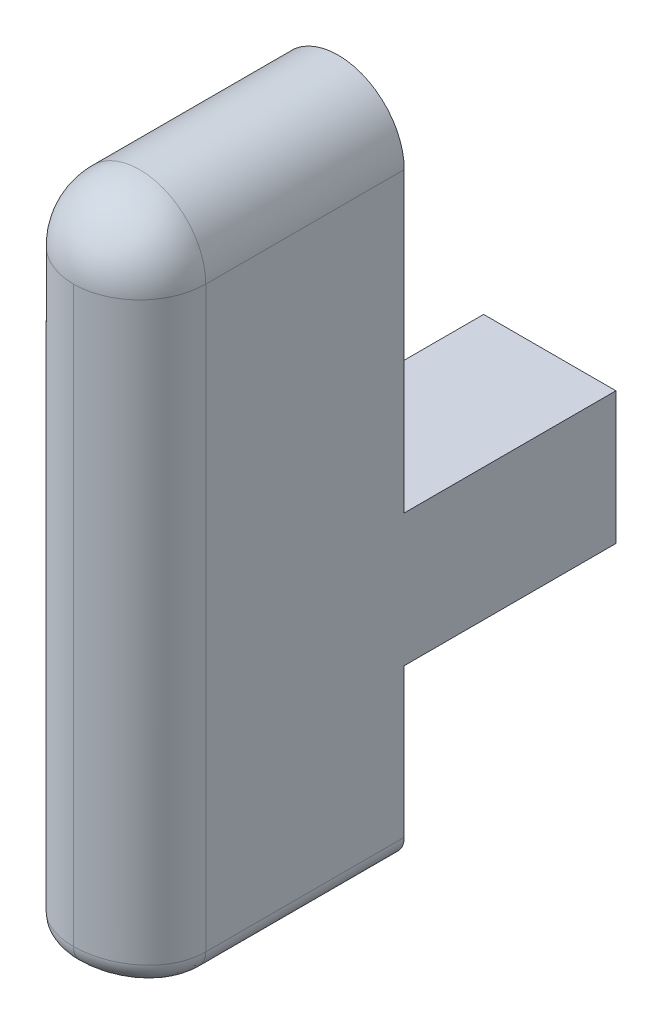
ISO-10303-21;
HEADER;
FILE_DESCRIPTION(('STEP AP214'),'2;1');
FILE_NAME('part.step','',(''),(''),'','','');
FILE_SCHEMA(('AUTOMOTIVE_DESIGN { 1 0 10303 214 1 1 1 1 }'));
ENDSEC;
DATA;
#1=APPLICATION_CONTEXT('core data for automotive mechanical design processes');
#2=APPLICATION_PROTOCOL_DEFINITION('international standard','automotive_design',2000,#1);
#3=PRODUCT_CONTEXT('',#1,'mechanical');
#4=PRODUCT('Part','Part','',(#3));
#5=PRODUCT_RELATED_PRODUCT_CATEGORY('part','',(#4));
#6=PRODUCT_DEFINITION_FORMATION('','',#4);
#7=PRODUCT_DEFINITION_CONTEXT('part definition',#1,'design');
#8=PRODUCT_DEFINITION('design','',#6,#7);
#9=PRODUCT_DEFINITION_SHAPE('','',#8);
#10=(LENGTH_UNIT() NAMED_UNIT(*) SI_UNIT(.MILLI.,.METRE.));
#11=(NAMED_UNIT(*) PLANE_ANGLE_UNIT() SI_UNIT($,.RADIAN.));
#12=(NAMED_UNIT(*) SI_UNIT($,.STERADIAN.) SOLID_ANGLE_UNIT());
#13=UNCERTAINTY_MEASURE_WITH_UNIT(LENGTH_MEASURE(1.E-05),#10,'distance_accuracy_value','');
#14=(GEOMETRIC_REPRESENTATION_CONTEXT(3) GLOBAL_UNCERTAINTY_ASSIGNED_CONTEXT((#13)) GLOBAL_UNIT_ASSIGNED_CONTEXT((#10,
#11,#12)) REPRESENTATION_CONTEXT('',''));
#15=CARTESIAN_POINT('',(0.,0.,0.));
#16=DIRECTION('',(0.,0.,1.));
#17=DIRECTION('',(1.,0.,0.));
#18=AXIS2_PLACEMENT_3D('',#15,#16,#17);
#19=CARTESIAN_POINT('',(29.6862500346852,-147.168099904877,3.175));
#20=DIRECTION('',(1.,0.,0.));
#21=DIRECTION('',(0.,0.,-1.));
#22=AXIS2_PLACEMENT_3D('',#19,#20,#21);
#23=PLANE('',#22);
#24=DIRECTION('',(0.,-1.,0.));
#25=VECTOR('',#24,1.);
#26=CARTESIAN_POINT('',(29.6862500346852,-147.168099904877,0.));
#27=LINE('',#26,#25);
#28=CARTESIAN_POINT('',(29.6862500346852,-152.324299852115,0.));
#29=VERTEX_POINT('',#28);
#30=CARTESIAN_POINT('',(29.6862500346852,-154.10736760588,0.));
#31=VERTEX_POINT('',#30);
#32=EDGE_CURVE('E160',#29,#31,#27,.T.);
#33=ORIENTED_EDGE('',*,*,#32,.T.);
#34=DIRECTION('',(0.,0.,1.));
#35=VECTOR('',#34,1.);
#36=CARTESIAN_POINT('',(29.6862500346852,-154.10736760588,2.38125));
#37=LINE('',#36,#35);
#38=CARTESIAN_POINT('',(29.6862500346852,-154.10736760588,2.38125));
#39=VERTEX_POINT('',#38);
#40=EDGE_CURVE('E11',#31,#39,#37,.T.);
#41=ORIENTED_EDGE('',*,*,#40,.T.);
#42=DIRECTION('',(0.,-1.,0.));
#43=VECTOR('',#42,1.);
#44=CARTESIAN_POINT('',(29.6862500346852,-147.168099904877,2.38125));
#45=LINE('',#44,#43);
#46=CARTESIAN_POINT('',(29.6862500346852,-147.168099904877,2.38125));
#47=VERTEX_POINT('',#46);
#48=EDGE_CURVE('E321',#39,#47,#45,.F.);
#49=ORIENTED_EDGE('',*,*,#48,.T.);
#50=DIRECTION('',(0.,0.,-1.));
#51=VECTOR('',#50,1.);
#52=CARTESIAN_POINT('',(29.6862500346852,-147.168099904877,3.175));
#53=LINE('',#52,#51);
#54=CARTESIAN_POINT('',(29.6862500346852,-147.168099904877,0.));
#55=VERTEX_POINT('',#54);
#56=EDGE_CURVE('E194',#47,#55,#53,.T.);
#57=ORIENTED_EDGE('',*,*,#56,.T.);
#58=CARTESIAN_POINT('',(29.6862500346852,-150.736799852115,0.));
#59=VERTEX_POINT('',#58);
#60=EDGE_CURVE('E188',#55,#59,#27,.T.);
#61=ORIENTED_EDGE('',*,*,#60,.T.);
#62=DIRECTION('',(0.,0.,1.));
#63=VECTOR('',#62,1.);
#64=CARTESIAN_POINT('',(29.6862500346852,-150.736799852115,-2.54000000000001));
#65=LINE('',#64,#63);
#66=CARTESIAN_POINT('',(29.6862500346852,-150.736799852115,-2.54000000000001));
#67=VERTEX_POINT('',#66);
#68=EDGE_CURVE('E162',#67,#59,#65,.T.);
#69=ORIENTED_EDGE('',*,*,#68,.F.);
#70=DIRECTION('',(0.,1.,0.));
#71=VECTOR('',#70,1.);
#72=CARTESIAN_POINT('',(29.6862500346852,-152.324299852115,-2.54));
#73=LINE('',#72,#71);
#74=CARTESIAN_POINT('',(29.6862500346852,-152.324299852115,-2.54));
#75=VERTEX_POINT('',#74);
#76=EDGE_CURVE('E140',#75,#67,#73,.T.);
#77=ORIENTED_EDGE('',*,*,#76,.F.);
#78=DIRECTION('',(0.,0.,1.));
#79=VECTOR('',#78,1.);
#80=CARTESIAN_POINT('',(29.6862500346852,-152.324299852115,-2.54));
#81=LINE('',#80,#79);
#82=EDGE_CURVE('E137',#75,#29,#81,.T.);
#83=ORIENTED_EDGE('',*,*,#82,.T.);
#84=EDGE_LOOP('',(#33,#41,#49,#57,#61,#69,#77,#83));
#85=FACE_BOUND('',#84,.T.);
#86=ADVANCED_FACE('F38',(#85),#23,.F.);
#87=CARTESIAN_POINT('',(31.2737500346852,-147.168099904877,3.175));
#88=DIRECTION('',(-1.,0.,0.));
#89=DIRECTION('',(0.,0.,1.));
#90=AXIS2_PLACEMENT_3D('',#87,#88,#89);
#91=PLANE('',#90);
#92=DIRECTION('',(0.,1.,0.));
#93=VECTOR('',#92,1.);
#94=CARTESIAN_POINT('',(31.2737500346852,-147.168099904877,2.38125));
#95=LINE('',#94,#93);
#96=CARTESIAN_POINT('',(31.2737500346852,-147.168099904877,2.38125));
#97=VERTEX_POINT('',#96);
#98=CARTESIAN_POINT('',(31.2737500346853,-154.10736760588,2.38124999999999));
#99=VERTEX_POINT('',#98);
#100=EDGE_CURVE('E195',#97,#99,#95,.F.);
#101=ORIENTED_EDGE('',*,*,#100,.T.);
#102=DIRECTION('',(0.,0.,1.));
#103=VECTOR('',#102,1.);
#104=CARTESIAN_POINT('',(31.2737500346853,-154.10736760588,0.));
#105=LINE('',#104,#103);
#106=CARTESIAN_POINT('',(31.2737500346853,-154.10736760588,0.));
#107=VERTEX_POINT('',#106);
#108=EDGE_CURVE('E204',#99,#107,#105,.F.);
#109=ORIENTED_EDGE('',*,*,#108,.T.);
#110=DIRECTION('',(0.,1.,0.));
#111=VECTOR('',#110,1.);
#112=CARTESIAN_POINT('',(31.2737500346852,-147.168099904877,0.));
#113=LINE('',#112,#111);
#114=CARTESIAN_POINT('',(31.2737500346852,-152.324299852115,0.));
#115=VERTEX_POINT('',#114);
#116=EDGE_CURVE('E155',#107,#115,#113,.T.);
#117=ORIENTED_EDGE('',*,*,#116,.T.);
#118=DIRECTION('',(0.,0.,1.));
#119=VECTOR('',#118,1.);
#120=CARTESIAN_POINT('',(31.2737500346852,-152.324299852115,-2.54));
#121=LINE('',#120,#119);
#122=CARTESIAN_POINT('',(31.2737500346852,-152.324299852115,-2.54));
#123=VERTEX_POINT('',#122);
#124=EDGE_CURVE('E135',#123,#115,#121,.T.);
#125=ORIENTED_EDGE('',*,*,#124,.F.);
#126=DIRECTION('',(0.,-1.,0.));
#127=VECTOR('',#126,1.);
#128=CARTESIAN_POINT('',(31.2737500346852,-152.324299852115,-2.54));
#129=LINE('',#128,#127);
#130=CARTESIAN_POINT('',(31.2737500346852,-150.736799852115,-2.54));
#131=VERTEX_POINT('',#130);
#132=EDGE_CURVE('E141',#131,#123,#129,.T.);
#133=ORIENTED_EDGE('',*,*,#132,.F.);
#134=DIRECTION('',(0.,0.,1.));
#135=VECTOR('',#134,1.);
#136=CARTESIAN_POINT('',(31.2737500346852,-150.736799852115,-2.54));
#137=LINE('',#136,#135);
#138=CARTESIAN_POINT('',(31.2737500346852,-150.736799852115,0.));
#139=VERTEX_POINT('',#138);
#140=EDGE_CURVE('E173',#131,#139,#137,.T.);
#141=ORIENTED_EDGE('',*,*,#140,.T.);
#142=CARTESIAN_POINT('',(31.2737500346852,-147.168099904877,0.));
#143=VERTEX_POINT('',#142);
#144=EDGE_CURVE('E191',#139,#143,#113,.T.);
#145=ORIENTED_EDGE('',*,*,#144,.T.);
#146=DIRECTION('',(0.,0.,-1.));
#147=VECTOR('',#146,1.);
#148=CARTESIAN_POINT('',(31.2737500346852,-147.168099904877,3.175));
#149=LINE('',#148,#147);
#150=EDGE_CURVE('E196',#97,#143,#149,.T.);
#151=ORIENTED_EDGE('',*,*,#150,.F.);
#152=EDGE_LOOP('',(#101,#109,#117,#125,#133,#141,#145,#151));
#153=FACE_BOUND('',#152,.T.);
#154=ADVANCED_FACE('F153',(#153),#91,.F.);
#155=CARTESIAN_POINT('',(30.4800000346852,-147.168099904877,2.38125));
#156=DIRECTION('',(0.,-1.,0.));
#157=DIRECTION('',(0.,0.,-1.));
#158=AXIS2_PLACEMENT_3D('',#155,#156,#157);
#159=CYLINDRICAL_SURFACE('',#158,0.79375);
#160=ORIENTED_EDGE('',*,*,#48,.F.);
#161=CARTESIAN_POINT('',(30.0190954615625,-154.35053094467,2.20472528282953));
#162=CARTESIAN_POINT('',(29.7363361448432,-154.40631555659,2.10305886107383));
#163=CARTESIAN_POINT('',(29.7299004352895,-154.101334266837,2.12165482769048));
#164=CARTESIAN_POINT('',(30.010222290582,-154.352294962349,2.23301837124041));
#165=CARTESIAN_POINT('',(29.7199308635351,-154.410706056037,2.14696118531071));
#166=CARTESIAN_POINT('',(29.715459784478,-154.103286446402,2.16326231064766));
#167=CARTESIAN_POINT('',(30.0035148991015,-154.35365795357,2.26216670540272));
#168=CARTESIAN_POINT('',(29.7074227209092,-154.414127210069,2.19254180018184));
#169=CARTESIAN_POINT('',(29.7045438336372,-154.104794823353,2.20612750794517));
#170=CARTESIAN_POINT('',(29.994543250472,-154.355500967275,2.32129260410947));
#171=CARTESIAN_POINT('',(29.6905496128658,-154.418792072712,2.28592224933391));
#172=CARTESIAN_POINT('',(29.6899429152794,-154.106834425187,2.29307735898451));
#173=CARTESIAN_POINT('',(29.9922745563735,-154.35598187147,2.35126931017053));
#174=CARTESIAN_POINT('',(29.6862512199495,-154.420017644134,2.33352514580003));
#175=CARTESIAN_POINT('',(29.6862507268447,-154.107366625829,2.33716075025078));
#176=CARTESIAN_POINT('',(29.9922737055121,-154.355983643179,2.41124872004354));
#177=CARTESIAN_POINT('',(29.6862488487016,-154.420022343227,2.42900381543561));
#178=CARTESIAN_POINT('',(29.6862493421094,-154.107368586521,2.42536576476991));
#179=CARTESIAN_POINT('',(29.9945442778171,-154.355503933159,2.44125142864857));
#180=CARTESIAN_POINT('',(29.6905500867908,-154.418799976249,2.47664796758938));
#181=CARTESIAN_POINT('',(29.6899445872332,-154.106837707432,2.46948739507142));
#182=CARTESIAN_POINT('',(30.003524722229,-154.353652746261,2.50036059645146));
#183=CARTESIAN_POINT('',(29.7074424081888,-154.414113738994,2.56999957584499));
#184=CARTESIAN_POINT('',(29.7045598202957,-154.104789060598,2.55641264184039));
#185=CARTESIAN_POINT('',(30.0102336994338,-154.352281449152,2.52946723508336));
#186=CARTESIAN_POINT('',(29.7199561727939,-154.410671037828,2.61550967983727));
#187=CARTESIAN_POINT('',(29.7154783518251,-154.103271491798,2.59921652218143));
#188=CARTESIAN_POINT('',(30.0367479741813,-154.347043962959,2.61416284602012));
#189=CARTESIAN_POINT('',(29.7685478518811,-154.39775037191,2.74583367278719));
#190=CARTESIAN_POINT('',(29.7586290342572,-154.097475340409,2.72376889120602));
#191=CARTESIAN_POINT('',(30.0629427613963,-154.342052282161,2.66737991278407));
#192=CARTESIAN_POINT('',(29.8153366304374,-154.385753680094,2.82523532848841));
#193=CARTESIAN_POINT('',(29.8012597663908,-154.091951213654,2.80202928350579));
#194=CARTESIAN_POINT('',(30.1299795228078,-154.331128529394,2.76197144584675));
#195=CARTESIAN_POINT('',(29.9305755848705,-154.360460073456,2.96171337376028));
#196=CARTESIAN_POINT('',(29.9103588094736,-154.079862260605,2.94113447918671));
#197=CARTESIAN_POINT('',(30.1710114330585,-154.325184846977,2.80317921809984));
#198=CARTESIAN_POINT('',(29.9986140146209,-154.347212217448,3.01887599233316));
#199=CARTESIAN_POINT('',(29.9771362320403,-154.073284585415,3.00173414426548));
#200=CARTESIAN_POINT('',(30.2401684893008,-154.317490240435,2.85223783415591));
#201=CARTESIAN_POINT('',(30.1100571328299,-154.330527385741,3.0852432715706));
#202=CARTESIAN_POINT('',(30.0896859510191,-154.064769220805,3.07387916787592));
#203=CARTESIAN_POINT('',(30.2646731696816,-154.31511754292,2.86651529681728));
#204=CARTESIAN_POINT('',(30.148807432488,-154.325484485454,3.10419555842418));
#205=CARTESIAN_POINT('',(30.1295661171266,-154.062143435531,3.09487543649469));
#206=CARTESIAN_POINT('',(30.3155408843896,-154.311049242776,2.89030411259103));
#207=CARTESIAN_POINT('',(30.2282396351819,-154.316945005771,3.13539846656659));
#208=CARTESIAN_POINT('',(30.2123508292986,-154.057641183372,3.12985898910292));
#209=CARTESIAN_POINT('',(30.3419019138334,-154.309352922456,2.89982052031687));
#210=CARTESIAN_POINT('',(30.2690176276568,-154.313421329336,3.14775815064396));
#211=CARTESIAN_POINT('',(30.2552521125135,-154.055763922242,3.14385370634748));
#212=CARTESIAN_POINT('',(30.4052049398057,-154.306398673166,2.91620861939051));
#213=CARTESIAN_POINT('',(30.3660511810971,-154.307339711755,3.16885877589263));
#214=CARTESIAN_POINT('',(30.3582746841965,-154.052494553056,3.16795385204613));
#215=CARTESIAN_POINT('',(30.4426266864548,-154.305500814068,2.92099557631674));
#216=CARTESIAN_POINT('',(30.4231671812699,-154.305501937081,3.174993855962));
#217=CARTESIAN_POINT('',(30.4191767424675,-154.051500922316,3.17499349458629));
#218=CARTESIAN_POINT('',(30.5070751310385,-154.305499064242,2.92100320473427));
#219=CARTESIAN_POINT('',(30.5211724207736,-154.305498250681,3.17500445102944));
#220=CARTESIAN_POINT('',(30.5240634267893,-154.051498985822,3.17500471284248));
#221=CARTESIAN_POINT('',(30.5341248266045,-154.305969017102,2.91849640783471));
#222=CARTESIAN_POINT('',(30.5623852683307,-154.306459239278,3.17179512091351));
#223=CARTESIAN_POINT('',(30.5680854803575,-154.052019066976,3.17131824680933));
#224=CARTESIAN_POINT('',(30.5875530557674,-154.307775685626,2.9085723742009));
#225=CARTESIAN_POINT('',(30.6440228024742,-154.310165272317,3.15905830472131));
#226=CARTESIAN_POINT('',(30.6550373042894,-154.054018446802,3.15672407969738));
#227=CARTESIAN_POINT('',(30.6139287040349,-154.309115633269,2.9011368252775));
#228=CARTESIAN_POINT('',(30.6845876933724,-154.312930360919,3.14946052753039));
#229=CARTESIAN_POINT('',(30.697962378921,-154.055501322197,3.14578944892868));
#230=CARTESIAN_POINT('',(30.6395520279879,-154.310851080144,2.89130175174036));
#231=CARTESIAN_POINT('',(30.7241249298902,-154.316530520505,3.1367051384607));
#232=CARTESIAN_POINT('',(30.7396630826092,-154.057421883429,3.1313261055005));
#233=(BOUNDED_SURFACE() B_SPLINE_SURFACE(3,2,((#161,#162,#163),(#164,#165,#166),(#167,#168,
#169),(#170,#171,#172),(#173,#174,#175),(#176,#177,#178),(#179,#180,#181),(#182,#183,#184),
(#185,#186,#187),(#188,#189,#190),(#191,#192,#193),(#194,#195,#196),(#197,#198,#199),(#200,#201,
#202),(#203,#204,#205),(#206,#207,#208),(#209,#210,#211),(#212,#213,#214),(#215,#216,#217),
(#218,#219,#220),(#221,#222,#223),(#224,#225,#226),(#227,#228,#229),(#230,#231,#232)),
.UNSPECIFIED.,.F.,.F.,.F.) B_SPLINE_SURFACE_WITH_KNOTS((4,2,2,2,2,2,2,2,2,2,2,4),(3,3),(0.,
0.0899203267723532,0.179750722613885,0.269635141937735,0.359501443660433,0.538513924713583,
0.719904218641914,0.811798456575495,0.903594926096069,1.02745425689798,1.11718406368523,
1.20724913359054),(0.,1.),
.UNSPECIFIED.) GEOMETRIC_REPRESENTATION_ITEM() RATIONAL_B_SPLINE_SURFACE(((1.,0.639174628847301,
1.),(1.,0.636395349941399,1.),(1.,0.634238700165722,1.),(1.,0.631316410932524,1.),(1.,
0.630549382457804,1.),(1.,0.630545952234362,1.),(1.,0.631310471273145,1.),(1.,0.63424819729852,
1.),(1.,0.636421120311109,1.),(1.,0.644659581329108,1.),(1.,0.652448303646025,1.),(1.,
0.669172025500029,1.),(1.,0.678120876758144,1.),(1.,0.689559037190209,1.),(1.,0.6930569692531,
1.),(1.,0.699029056335582,1.),(1.,0.701504296615913,1.),(1.,0.705806659923669,1.),(1.,
0.707105432929675,1.),(1.,0.707107757930309,1.),(1.,0.706427811390392,1.),(1.,0.703801421388125,
1.),(1.,0.701850255326034,1.),(1.,0.699314254390197,1.))) REPRESENTATION_ITEM('') SURFACE());
#234=CARTESIAN_POINT('',(29.7299004352895,-154.101334266837,2.12165482769048));
#235=CARTESIAN_POINT('',(29.715459784478,-154.103286446402,2.16326231064766));
#236=CARTESIAN_POINT('',(29.7045438336372,-154.104794823353,2.20612750794517));
#237=CARTESIAN_POINT('',(29.6899429152794,-154.106834425187,2.29307735898451));
#238=CARTESIAN_POINT('',(29.6862507268447,-154.107366625829,2.33716075025078));
#239=CARTESIAN_POINT('',(29.6862493421094,-154.107368586521,2.42536576476991));
#240=CARTESIAN_POINT('',(29.6899445872332,-154.106837707432,2.46948739507142));
#241=CARTESIAN_POINT('',(29.7045598202957,-154.104789060598,2.55641264184039));
#242=CARTESIAN_POINT('',(29.7154783518251,-154.103271491798,2.59921652218143));
#243=CARTESIAN_POINT('',(29.7586290342572,-154.097475340409,2.72376889120602));
#244=CARTESIAN_POINT('',(29.8012597663908,-154.091951213654,2.80202928350579));
#245=CARTESIAN_POINT('',(29.9103588094736,-154.079862260605,2.94113447918671));
#246=CARTESIAN_POINT('',(29.9771362320403,-154.073284585415,3.00173414426548));
#247=CARTESIAN_POINT('',(30.0896859510191,-154.064769220805,3.07387916787592));
#248=CARTESIAN_POINT('',(30.1295661171266,-154.062143435531,3.09487543649469));
#249=CARTESIAN_POINT('',(30.2123508292986,-154.057641183372,3.12985898910292));
#250=CARTESIAN_POINT('',(30.2552521125135,-154.055763922242,3.14385370634748));
#251=CARTESIAN_POINT('',(30.3582746841965,-154.052494553056,3.16795385204613));
#252=CARTESIAN_POINT('',(30.4191767424675,-154.051500922316,3.17499349458629));
#253=CARTESIAN_POINT('',(30.5240634267893,-154.051498985822,3.17500471284248));
#254=CARTESIAN_POINT('',(30.5680854803575,-154.052019066976,3.17131824680933));
#255=CARTESIAN_POINT('',(30.6550373042894,-154.054018446802,3.15672407969738));
#256=CARTESIAN_POINT('',(30.697962378921,-154.055501322197,3.14578944892868));
#257=CARTESIAN_POINT('',(30.7396630826092,-154.057421883429,3.1313261055005));
#258=B_SPLINE_CURVE_WITH_KNOTS('',3,(#234,#235,#236,#237,#238,#239,#240,#241,#242,#243,#244,
#245,#246,#247,#248,#249,#250,#251,#252,#253,#254,#255,#256,#257),.UNSPECIFIED.,.F.,.F.,(4,2,2,
2,2,2,2,2,2,2,2,4),(0.,0.0899203267723532,0.179750722613885,0.269635141937735,0.359501443660433,
0.538513924713583,0.719904218641914,0.811798456575495,0.903594926096069,1.02745425689798,
1.11718406368523,1.20724913359054),.UNSPECIFIED.);
#259=CARTESIAN_POINT('',(30.4800000346852,-154.051499799352,3.17499999999999));
#260=VERTEX_POINT('',#259);
#261=EDGE_CURVE('E52',#39,#260,#258,.T.);
#262=ORIENTED_EDGE('',*,*,#261,.T.);
#263=DIRECTION('',(0.,-1.,0.));
#264=VECTOR('',#263,1.);
#265=CARTESIAN_POINT('',(30.4800000346852,-147.168099904877,3.175));
#266=LINE('',#265,#264);
#267=CARTESIAN_POINT('',(30.4800000346852,-147.168099904877,3.175));
#268=VERTEX_POINT('',#267);
#269=EDGE_CURVE('E309',#268,#260,#266,.T.);
#270=ORIENTED_EDGE('',*,*,#269,.F.);
#271=CARTESIAN_POINT('',(30.4800000346852,-147.168099904877,2.38125));
#272=DIRECTION('',(0.,1.,0.));
#273=DIRECTION('',(0.,0.,1.));
#274=AXIS2_PLACEMENT_3D('',#271,#272,#273);
#275=CIRCLE('',#274,0.79375);
#276=EDGE_CURVE('E325',#47,#268,#275,.T.);
#277=ORIENTED_EDGE('',*,*,#276,.F.);
#278=EDGE_LOOP('',(#160,#262,#270,#277));
#279=FACE_BOUND('',#278,.T.);
#280=ADVANCED_FACE('F266',(#279),#159,.T.);
#281=CARTESIAN_POINT('',(30.4800000346852,-147.168099904877,2.38125));
#282=DIRECTION('',(0.,1.,0.));
#283=DIRECTION('',(0.,0.,1.));
#284=AXIS2_PLACEMENT_3D('',#281,#282,#283);
#285=CYLINDRICAL_SURFACE('',#284,0.79375);
#286=ORIENTED_EDGE('',*,*,#269,.T.);
#287=CARTESIAN_POINT('',(30.3204480413826,-154.310851080144,2.89130175174036));
#288=CARTESIAN_POINT('',(30.2358751394804,-154.316530520505,3.13670513846072));
#289=CARTESIAN_POINT('',(30.2203369867613,-154.057421883429,3.13132610550057));
#290=CARTESIAN_POINT('',(30.3460212576905,-154.309116521114,2.90112688984642));
#291=CARTESIAN_POINT('',(30.2753364388052,-154.312932034877,3.14944865026572));
#292=CARTESIAN_POINT('',(30.2619561427082,-154.055502304534,3.14577483797443));
#293=CARTESIAN_POINT('',(30.372366877436,-154.307778637633,2.90855367472874));
#294=CARTESIAN_POINT('',(30.315854868883,-154.310171268551,3.15903470017997));
#295=CARTESIAN_POINT('',(30.3048323473914,-154.054021713466,3.15669658044605));
#296=CARTESIAN_POINT('',(30.4258076569461,-154.305971094841,2.91848760596769));
#297=CARTESIAN_POINT('',(30.3975113850452,-154.306463569529,3.17178338412646));
#298=CARTESIAN_POINT('',(30.3918045964,-154.052021366211,3.17130530287141));
#299=CARTESIAN_POINT('',(30.4529020608575,-154.305500590275,2.9209995419541));
#300=CARTESIAN_POINT('',(30.4387923066437,-154.305501522192,3.17499886334858));
#301=CARTESIAN_POINT('',(30.4358994106113,-154.051500674609,3.17499932639834));
#302=CARTESIAN_POINT('',(30.507114017504,-154.305499007962,2.92100045831648));
#303=CARTESIAN_POINT('',(30.5212319973413,-154.305498075499,3.17500113731987));
#304=CARTESIAN_POINT('',(30.5241267126074,-154.051498923579,3.17500067399962));
#305=CARTESIAN_POINT('',(30.5342315744585,-154.305968485376,2.91848647034472));
#306=CARTESIAN_POINT('',(30.5625495654478,-154.30645780047,3.17178415093121));
#307=CARTESIAN_POINT('',(30.5682592072589,-154.052018478529,3.17130363285671));
#308=CARTESIAN_POINT('',(30.587657368622,-154.307783405689,2.90854300812921));
#309=CARTESIAN_POINT('',(30.6441815687705,-154.31018152065,3.15901866833815));
#310=CARTESIAN_POINT('',(30.6552070683474,-154.05402699032,3.15668089430093));
#311=CARTESIAN_POINT('',(30.6139657709995,-154.309128668559,2.90111454411432));
#312=CARTESIAN_POINT('',(30.6846410587497,-154.312958700599,3.14942445380592));
#313=CARTESIAN_POINT('',(30.698022703588,-154.055515747929,3.14575668251871));
#314=CARTESIAN_POINT('',(30.6905211854872,-154.314282213795,2.87175415787998));
#315=CARTESIAN_POINT('',(30.8036329014504,-154.323723030946,3.11109247856892));
#316=CARTESIAN_POINT('',(30.8226128879529,-154.061219004694,3.10257964394577));
#317=CARTESIAN_POINT('',(30.7386246739104,-154.319209975998,2.84274490138248));
#318=CARTESIAN_POINT('',(30.8799608083585,-154.334216844096,3.07252312540818));
#319=CARTESIAN_POINT('',(30.9008989573567,-154.066672394809,3.05991897262238));
#320=CARTESIAN_POINT('',(30.8240874438783,-154.330081111543,2.76853665302118));
#321=CARTESIAN_POINT('',(31.0194808364022,-154.358106883358,2.9708478978907));
#322=CARTESIAN_POINT('',(31.039985426106,-154.078703118209,2.95078919561821));
#323=CARTESIAN_POINT('',(30.8613026968599,-154.336036574842,2.72313696479954));
#324=CARTESIAN_POINT('',(31.0824821787588,-154.37166635741,2.90658389594241));
#325=CARTESIAN_POINT('',(31.1005514260247,-154.085293831048,2.88402494823481));
#326=CARTESIAN_POINT('',(30.9056149729653,-154.343796174129,2.64661738601594));
#327=CARTESIAN_POINT('',(31.1598376841989,-154.389910397955,2.79444676127828));
#328=CARTESIAN_POINT('',(31.1726674832805,-154.093881120694,2.77149615590571));
#329=CARTESIAN_POINT('',(30.9185139812228,-154.346199138479,2.61949733378141));
#330=CARTESIAN_POINT('',(31.1829148609015,-154.395699597594,2.75377446492337));
#331=CARTESIAN_POINT('',(31.1936599869562,-154.096540401093,2.73161372614856));
#332=CARTESIAN_POINT('',(30.940005194815,-154.350328184695,2.56320044042425));
#333=CARTESIAN_POINT('',(31.2220014771209,-154.405812217589,2.66782350709153));
#334=CARTESIAN_POINT('',(31.2286358835849,-154.101109878911,2.64882417709386));
#335=CARTESIAN_POINT('',(30.9486020118166,-154.352054990924,2.53402584008893));
#336=CARTESIAN_POINT('',(31.2378849649996,-154.410106339714,2.6226391940646));
#337=CARTESIAN_POINT('',(31.2426267817999,-154.103020877958,2.60592035307177));
#338=CARTESIAN_POINT('',(30.9634001049435,-154.355064101371,2.46398645654885));
#339=CARTESIAN_POINT('',(31.265562520919,-154.417681072135,2.51264887694403));
#340=CARTESIAN_POINT('',(31.2667099529238,-154.106350960343,2.50292125963092));
#341=CARTESIAN_POINT('',(30.9677219403011,-154.35598167546,2.4225914726171));
#342=CARTESIAN_POINT('',(31.2737423908271,-154.420017172498,2.44705963557797));
#343=CARTESIAN_POINT('',(31.2737435281324,-154.107366408934,2.4420462832605));
#344=CARTESIAN_POINT('',(30.9677288352081,-154.355983540773,2.35129439607837));
#345=CARTESIAN_POINT('',(31.2737555733747,-154.420022036662,2.33356476892309));
#346=CARTESIAN_POINT('',(31.2737547492661,-154.107368473175,2.33719764129168));
#347=CARTESIAN_POINT('',(30.9654647371601,-154.355503138263,2.32136688721229));
#348=CARTESIAN_POINT('',(31.2694656489509,-154.41879766548,2.28603976949753));
#349=CARTESIAN_POINT('',(31.270070040676,-154.106836827739,2.29318659884158));
#350=CARTESIAN_POINT('',(30.956501937607,-154.353660881672,2.2622548582076));
#351=CARTESIAN_POINT('',(31.2526085476344,-154.414134518797,2.19268073011539));
#352=CARTESIAN_POINT('',(31.2554835237517,-154.104798063794,2.20625714442297));
#353=CARTESIAN_POINT('',(30.9497866617544,-154.352295733587,2.23307353996995));
#354=CARTESIAN_POINT('',(31.2400853769134,-154.410707850533,2.14704868926562));
#355=CARTESIAN_POINT('',(31.2445547414797,-154.103287299922,2.16334344113232));
#356=CARTESIAN_POINT('',(30.9409046078078,-154.35053094467,2.20472528282952));
#357=CARTESIAN_POINT('',(31.2236639245271,-154.40631555659,2.10305886107381));
#358=CARTESIAN_POINT('',(31.2300996340809,-154.101334266837,2.12165482769046));
#359=(BOUNDED_SURFACE() B_SPLINE_SURFACE(3,2,((#287,#288,#289),(#290,#291,#292),(#293,#294,
#295),(#296,#297,#298),(#299,#300,#301),(#302,#303,#304),(#305,#306,#307),(#308,#309,#310),
(#311,#312,#313),(#314,#315,#316),(#317,#318,#319),(#320,#321,#322),(#323,#324,#325),(#326,#327,
#328),(#329,#330,#331),(#332,#333,#334),(#335,#336,#337),(#338,#339,#340),(#341,#342,#343),
(#344,#345,#346),(#347,#348,#349),(#350,#351,#352),(#353,#354,#355),(#356,#357,#358)),
.UNSPECIFIED.,.F.,.F.,.F.) B_SPLINE_SURFACE_WITH_KNOTS((4,2,2,2,2,2,2,2,2,2,2,4),(3,3),(0.,
0.0899412843365822,0.179794875145338,0.269701549824502,0.359589748860291,0.538651726392312,
0.719985075234557,0.811888793228071,0.903693784306036,1.02749819965085,1.11720559987254,
1.20724892408003),(0.,1.),
.UNSPECIFIED.) GEOMETRIC_REPRESENTATION_ITEM() RATIONAL_B_SPLINE_SURFACE(((1.,0.699314254390203,
1.),(1.,0.701848651854549,1.),(1.,0.703796975394682,1.),(1.,0.706424950333231,1.),(1.,
0.707105836845766,1.),(1.,0.707107726085228,1.),(1.,0.706427925179854,1.),(1.,0.703790864680677,
1.),(1.,0.701833867630809,1.),(1.,0.694295053490422,1.),(1.,0.687043238709779,1.),(1.,
0.670752989090583,1.),(1.,0.661693058127878,1.),(1.,0.649712988506656,1.),(1.,0.645968437090407,
1.),(1.,0.63949987070883,1.),(1.,0.63677476376068,1.),(1.,0.632013931383534,1.),(1.,
0.630549577640169,1.),(1.,0.630546284055909,1.),(1.,0.631312727478628,1.),(1.,0.634234290858282,
1.),(1.,0.636394600193453,1.),(1.,0.639174628847324,1.))) REPRESENTATION_ITEM('') SURFACE());
#360=CARTESIAN_POINT('',(30.2203369867613,-154.057421883429,3.13132610550057));
#361=CARTESIAN_POINT('',(30.2619561427082,-154.055502304534,3.14577483797443));
#362=CARTESIAN_POINT('',(30.3048323473914,-154.054021713466,3.15669658044605));
#363=CARTESIAN_POINT('',(30.3918045964,-154.052021366211,3.17130530287141));
#364=CARTESIAN_POINT('',(30.4358994106113,-154.051500674609,3.17499932639834));
#365=CARTESIAN_POINT('',(30.5241267126074,-154.051498923579,3.17500067399961));
#366=CARTESIAN_POINT('',(30.5682592072589,-154.052018478529,3.17130363285671));
#367=CARTESIAN_POINT('',(30.6552070683474,-154.05402699032,3.15668089430093));
#368=CARTESIAN_POINT('',(30.698022703588,-154.055515747929,3.14575668251871));
#369=CARTESIAN_POINT('',(30.8226128879529,-154.061219004694,3.10257964394577));
#370=CARTESIAN_POINT('',(30.9008989573567,-154.066672394809,3.05991897262238));
#371=CARTESIAN_POINT('',(31.039985426106,-154.078703118209,2.95078919561821));
#372=CARTESIAN_POINT('',(31.1005514260247,-154.085293831048,2.88402494823481));
#373=CARTESIAN_POINT('',(31.1726674832805,-154.093881120694,2.77149615590571));
#374=CARTESIAN_POINT('',(31.1936599869562,-154.096540401093,2.73161372614856));
#375=CARTESIAN_POINT('',(31.2286358835849,-154.101109878911,2.64882417709386));
#376=CARTESIAN_POINT('',(31.2426267817999,-154.103020877958,2.60592035307177));
#377=CARTESIAN_POINT('',(31.2667099529238,-154.106350960343,2.50292125963092));
#378=CARTESIAN_POINT('',(31.2737435281324,-154.107366408934,2.4420462832605));
#379=CARTESIAN_POINT('',(31.2737547492661,-154.107368473175,2.33719764129168));
#380=CARTESIAN_POINT('',(31.270070040676,-154.106836827739,2.29318659884158));
#381=CARTESIAN_POINT('',(31.2554835237517,-154.104798063794,2.20625714442297));
#382=CARTESIAN_POINT('',(31.2445547414797,-154.103287299922,2.16334344113232));
#383=CARTESIAN_POINT('',(31.2300996340809,-154.101334266837,2.12165482769046));
#384=B_SPLINE_CURVE_WITH_KNOTS('',3,(#360,#361,#362,#363,#364,#365,#366,#367,#368,#369,#370,
#371,#372,#373,#374,#375,#376,#377,#378,#379,#380,#381,#382,#383),.UNSPECIFIED.,.F.,.F.,(4,2,2,
2,2,2,2,2,2,2,2,4),(0.,0.0899412843365822,0.179794875145338,0.269701549824502,0.359589748860291,
0.538651726392312,0.719985075234557,0.811888793228071,0.903693784306036,1.02749819965085,
1.11720559987254,1.20724892408003),.UNSPECIFIED.);
#385=EDGE_CURVE('E210',#260,#99,#384,.T.);
#386=ORIENTED_EDGE('',*,*,#385,.T.);
#387=ORIENTED_EDGE('',*,*,#100,.F.);
#388=CARTESIAN_POINT('',(30.4800000346852,-147.168099904877,2.38125));
#389=DIRECTION('',(0.,-1.,0.));
#390=DIRECTION('',(0.,0.,-1.));
#391=AXIS2_PLACEMENT_3D('',#388,#389,#390);
#392=CIRCLE('',#391,0.79375);
#393=EDGE_CURVE('E304',#97,#268,#392,.T.);
#394=ORIENTED_EDGE('',*,*,#393,.T.);
#395=EDGE_LOOP('',(#286,#386,#387,#394));
#396=FACE_BOUND('',#395,.T.);
#397=ADVANCED_FACE('F224',(#396),#285,.T.);
#398=CARTESIAN_POINT('',(30.4800000346852,-147.168099904877,0.));
#399=DIRECTION('',(0.,0.,-1.));
#400=DIRECTION('',(-1.,0.,0.));
#401=AXIS2_PLACEMENT_3D('',#398,#399,#400);
#402=PLANE('',#401);
#403=DIRECTION('',(1.,0.,0.));
#404=VECTOR('',#403,1.);
#405=CARTESIAN_POINT('',(29.6862500346852,-150.736799852115,0.));
#406=LINE('',#405,#404);
#407=EDGE_CURVE('E150',#59,#139,#406,.T.);
#408=ORIENTED_EDGE('',*,*,#407,.F.);
#409=ORIENTED_EDGE('',*,*,#60,.F.);
#410=CARTESIAN_POINT('',(30.4800000346852,-147.168099904877,0.));
#411=DIRECTION('',(0.,0.,1.));
#412=DIRECTION('',(-1.,0.,0.));
#413=AXIS2_PLACEMENT_3D('',#410,#411,#412);
#414=CIRCLE('',#413,0.793750000000001);
#415=EDGE_CURVE('E157',#143,#55,#414,.T.);
#416=ORIENTED_EDGE('',*,*,#415,.F.);
#417=ORIENTED_EDGE('',*,*,#144,.F.);
#418=EDGE_LOOP('',(#408,#409,#416,#417));
#419=FACE_BOUND('',#418,.T.);
#420=ADVANCED_FACE('F333',(#419),#402,.T.);
#421=CARTESIAN_POINT('',(30.4800000346852,-147.168099904877,3.175));
#422=DIRECTION('',(0.,0.,-1.));
#423=DIRECTION('',(-1.,0.,0.));
#424=AXIS2_PLACEMENT_3D('',#421,#422,#423);
#425=CYLINDRICAL_SURFACE('',#424,0.793750000000001);
#426=ORIENTED_EDGE('',*,*,#56,.F.);
#427=CARTESIAN_POINT('',(30.4800000346852,-147.168099904877,2.38125));
#428=DIRECTION('',(0.,0.,-1.));
#429=DIRECTION('',(-1.,0.,0.));
#430=AXIS2_PLACEMENT_3D('',#427,#428,#429);
#431=CIRCLE('',#430,0.793750000000001);
#432=EDGE_CURVE('E323',#47,#97,#431,.T.);
#433=ORIENTED_EDGE('',*,*,#432,.T.);
#434=ORIENTED_EDGE('',*,*,#150,.T.);
#435=ORIENTED_EDGE('',*,*,#415,.T.);
#436=EDGE_LOOP('',(#426,#433,#434,#435));
#437=FACE_BOUND('',#436,.T.);
#438=ADVANCED_FACE('F338',(#437),#425,.T.);
#439=ORIENTED_EDGE('',*,*,#116,.F.);
#440=CARTESIAN_POINT('',(31.0197500346852,-154.10736760588,0.));
#441=DIRECTION('',(0.,0.,-1.));
#442=DIRECTION('',(-1.,0.,0.));
#443=AXIS2_PLACEMENT_3D('',#440,#441,#442);
#444=CIRCLE('',#443,0.254);
#445=CARTESIAN_POINT('',(30.9677259382997,-154.355982757058,0.));
#446=VERTEX_POINT('',#445);
#447=EDGE_CURVE('E208',#107,#446,#444,.T.);
#448=ORIENTED_EDGE('',*,*,#447,.T.);
#449=CARTESIAN_POINT('',(30.4800000346852,-156.686749799352,0.));
#450=DIRECTION('',(0.,0.,1.));
#451=DIRECTION('',(1.,0.,0.));
#452=AXIS2_PLACEMENT_3D('',#449,#450,#451);
#453=CIRCLE('',#452,2.38124999999999);
#454=CARTESIAN_POINT('',(29.9922741310708,-154.355982757058,0.));
#455=VERTEX_POINT('',#454);
#456=EDGE_CURVE('E293',#446,#455,#453,.T.);
#457=ORIENTED_EDGE('',*,*,#456,.T.);
#458=CARTESIAN_POINT('',(29.9402500346852,-154.10736760588,0.));
#459=DIRECTION('',(0.,0.,-1.));
#460=DIRECTION('',(-1.,0.,0.));
#461=AXIS2_PLACEMENT_3D('',#458,#459,#460);
#462=CIRCLE('',#461,0.254);
#463=EDGE_CURVE('E206',#455,#31,#462,.T.);
#464=ORIENTED_EDGE('',*,*,#463,.T.);
#465=ORIENTED_EDGE('',*,*,#32,.F.);
#466=DIRECTION('',(-1.,0.,0.));
#467=VECTOR('',#466,1.);
#468=CARTESIAN_POINT('',(29.6862500346852,-152.324299852115,0.));
#469=LINE('',#468,#467);
#470=EDGE_CURVE('E172',#115,#29,#469,.T.);
#471=ORIENTED_EDGE('',*,*,#470,.F.);
#472=EDGE_LOOP('',(#439,#448,#457,#464,#465,#471));
#473=FACE_BOUND('',#472,.T.);
#474=ADVANCED_FACE('F341',(#473),#402,.T.);
#475=CARTESIAN_POINT('',(29.6862500346852,-152.324299852115,-2.54));
#476=DIRECTION('',(0.,1.,0.));
#477=DIRECTION('',(0.,0.,1.));
#478=AXIS2_PLACEMENT_3D('',#475,#476,#477);
#479=PLANE('',#478);
#480=ORIENTED_EDGE('',*,*,#470,.T.);
#481=ORIENTED_EDGE('',*,*,#82,.F.);
#482=DIRECTION('',(-1.,0.,0.));
#483=VECTOR('',#482,1.);
#484=CARTESIAN_POINT('',(29.6862500346852,-152.324299852115,-2.54));
#485=LINE('',#484,#483);
#486=EDGE_CURVE('E130',#123,#75,#485,.T.);
#487=ORIENTED_EDGE('',*,*,#486,.F.);
#488=ORIENTED_EDGE('',*,*,#124,.T.);
#489=EDGE_LOOP('',(#480,#481,#487,#488));
#490=FACE_BOUND('',#489,.T.);
#491=ADVANCED_FACE('F133',(#490),#479,.F.);
#492=CARTESIAN_POINT('',(29.6862500346852,-150.736799852115,-2.54000000000001));
#493=DIRECTION('',(0.,-1.,0.));
#494=DIRECTION('',(0.,0.,-1.));
#495=AXIS2_PLACEMENT_3D('',#492,#493,#494);
#496=PLANE('',#495);
#497=ORIENTED_EDGE('',*,*,#407,.T.);
#498=ORIENTED_EDGE('',*,*,#140,.F.);
#499=DIRECTION('',(1.,0.,0.));
#500=VECTOR('',#499,1.);
#501=CARTESIAN_POINT('',(29.6862500346852,-150.736799852115,-2.54000000000001));
#502=LINE('',#501,#500);
#503=EDGE_CURVE('E146',#67,#131,#502,.T.);
#504=ORIENTED_EDGE('',*,*,#503,.F.);
#505=ORIENTED_EDGE('',*,*,#68,.T.);
#506=EDGE_LOOP('',(#497,#498,#504,#505));
#507=FACE_BOUND('',#506,.T.);
#508=ADVANCED_FACE('F331',(#507),#496,.F.);
#509=CARTESIAN_POINT('',(0.,0.,-2.54000000000001));
#510=DIRECTION('',(0.,0.,-1.));
#511=DIRECTION('',(-1.,0.,0.));
#512=AXIS2_PLACEMENT_3D('',#509,#510,#511);
#513=PLANE('',#512);
#514=ORIENTED_EDGE('',*,*,#132,.T.);
#515=ORIENTED_EDGE('',*,*,#486,.T.);
#516=ORIENTED_EDGE('',*,*,#76,.T.);
#517=ORIENTED_EDGE('',*,*,#503,.T.);
#518=EDGE_LOOP('',(#514,#515,#516,#517));
#519=FACE_BOUND('',#518,.T.);
#520=ADVANCED_FACE('F144',(#519),#513,.T.);
#521=CARTESIAN_POINT('',(30.4800000346852,-147.168099904877,2.38125));
#522=DIRECTION('',(0.,0.,-1.));
#523=DIRECTION('',(-1.,0.,0.));
#524=AXIS2_PLACEMENT_3D('',#521,#522,#523);
#525=SPHERICAL_SURFACE('',#524,0.79375);
#526=ORIENTED_EDGE('',*,*,#432,.F.);
#527=ORIENTED_EDGE('',*,*,#276,.T.);
#528=ORIENTED_EDGE('',*,*,#393,.F.);
#529=EDGE_LOOP('',(#526,#527,#528));
#530=FACE_BOUND('',#529,.T.);
#531=ADVANCED_FACE('F269',(#530),#525,.T.);
#532=CARTESIAN_POINT('',(30.4800000346853,-156.686749799352,3.17499999999999));
#533=DIRECTION('',(0.,0.,-1.));
#534=DIRECTION('',(-1.,0.,0.));
#535=AXIS2_PLACEMENT_3D('',#532,#533,#534);
#536=CYLINDRICAL_SURFACE('',#535,2.38124999999999);
#537=ORIENTED_EDGE('',*,*,#456,.F.);
#538=DIRECTION('',(0.,0.,-1.));
#539=VECTOR('',#538,1.);
#540=CARTESIAN_POINT('',(30.9677259382997,-154.355982757058,3.17499999999999));
#541=LINE('',#540,#539);
#542=CARTESIAN_POINT('',(30.9677259382997,-154.355982757058,2.38124999999999));
#543=VERTEX_POINT('',#542);
#544=EDGE_CURVE('E202',#446,#543,#541,.F.);
#545=ORIENTED_EDGE('',*,*,#544,.T.);
#546=CARTESIAN_POINT('',(30.9409046078078,-154.35053094467,2.20472528282952));
#547=CARTESIAN_POINT('',(30.9497866617544,-154.352295733587,2.23307353996995));
#548=CARTESIAN_POINT('',(30.956501937607,-154.353660881672,2.2622548582076));
#549=CARTESIAN_POINT('',(30.9654647371601,-154.355503138263,2.32136688721229));
#550=CARTESIAN_POINT('',(30.9677288352081,-154.355983540773,2.35129439607837));
#551=CARTESIAN_POINT('',(30.9677219403011,-154.35598167546,2.4225914726171));
#552=CARTESIAN_POINT('',(30.9634001049435,-154.355064101371,2.46398645654885));
#553=CARTESIAN_POINT('',(30.9486020118166,-154.352054990924,2.53402584008893));
#554=CARTESIAN_POINT('',(30.940005194815,-154.350328184695,2.56320044042425));
#555=CARTESIAN_POINT('',(30.9185139812228,-154.346199138479,2.61949733378141));
#556=CARTESIAN_POINT('',(30.9056149729653,-154.343796174129,2.64661738601594));
#557=CARTESIAN_POINT('',(30.8613026968599,-154.336036574842,2.72313696479954));
#558=CARTESIAN_POINT('',(30.8240874438783,-154.330081111543,2.76853665302118));
#559=CARTESIAN_POINT('',(30.7386246739104,-154.319209975998,2.84274490138248));
#560=CARTESIAN_POINT('',(30.6905211854872,-154.314282213795,2.87175415787998));
#561=CARTESIAN_POINT('',(30.6139657709995,-154.309128668559,2.90111454411432));
#562=CARTESIAN_POINT('',(30.587657368622,-154.307783405689,2.90854300812921));
#563=CARTESIAN_POINT('',(30.5342315744585,-154.305968485376,2.91848647034472));
#564=CARTESIAN_POINT('',(30.507114017504,-154.305499007962,2.92100045831648));
#565=CARTESIAN_POINT('',(30.4529020608575,-154.305500590275,2.9209995419541));
#566=CARTESIAN_POINT('',(30.4258076569461,-154.305971094841,2.91848760596769));
#567=CARTESIAN_POINT('',(30.372366877436,-154.307778637633,2.90855367472874));
#568=CARTESIAN_POINT('',(30.3460212576905,-154.309116521114,2.90112688984642));
#569=CARTESIAN_POINT('',(30.3204480413826,-154.310851080144,2.89130175174036));
#570=B_SPLINE_CURVE_WITH_KNOTS('',3,(#546,#547,#548,#549,#550,#551,#552,#553,#554,#555,#556,
#557,#558,#559,#560,#561,#562,#563,#564,#565,#566,#567,#568,#569),.UNSPECIFIED.,.F.,.F.,(4,2,2,
2,2,2,2,2,2,2,2,4),(0.,0.0900433242074885,0.179750724429175,0.303555139773993,0.395360130851959,
0.487263848845473,0.668597197687718,0.847659175219739,0.937547374255528,1.02745404893469,
1.11730763974345,1.20724892408003),.UNSPECIFIED.);
#571=CARTESIAN_POINT('',(30.4800000346852,-154.305499799352,2.92099999999999));
#572=VERTEX_POINT('',#571);
#573=EDGE_CURVE('E279',#543,#572,#570,.T.);
#574=ORIENTED_EDGE('',*,*,#573,.T.);
#575=CARTESIAN_POINT('',(30.6395520279879,-154.310851080144,2.89130175174036));
#576=CARTESIAN_POINT('',(30.6139287040349,-154.309115633269,2.9011368252775));
#577=CARTESIAN_POINT('',(30.5875530557674,-154.307775685626,2.9085723742009));
#578=CARTESIAN_POINT('',(30.5341248266045,-154.305969017102,2.91849640783471));
#579=CARTESIAN_POINT('',(30.5070751310385,-154.305499064242,2.92100320473427));
#580=CARTESIAN_POINT('',(30.4426266864548,-154.305500814068,2.92099557631674));
#581=CARTESIAN_POINT('',(30.4052049398057,-154.306398673166,2.91620861939051));
#582=CARTESIAN_POINT('',(30.3419019138334,-154.309352922456,2.89982052031687));
#583=CARTESIAN_POINT('',(30.3155408843896,-154.311049242776,2.89030411259103));
#584=CARTESIAN_POINT('',(30.2646731696816,-154.31511754292,2.86651529681728));
#585=CARTESIAN_POINT('',(30.2401684893008,-154.317490240435,2.85223783415591));
#586=CARTESIAN_POINT('',(30.1710114330585,-154.325184846977,2.80317921809984));
#587=CARTESIAN_POINT('',(30.1299795228078,-154.331128529394,2.76197144584675));
#588=CARTESIAN_POINT('',(30.0629427613963,-154.342052282161,2.66737991278407));
#589=CARTESIAN_POINT('',(30.0367479741813,-154.347043962959,2.61416284602012));
#590=CARTESIAN_POINT('',(30.0102336994338,-154.352281449152,2.52946723508336));
#591=CARTESIAN_POINT('',(30.003524722229,-154.353652746261,2.50036059645146));
#592=CARTESIAN_POINT('',(29.9945442778171,-154.355503933159,2.44125142864857));
#593=CARTESIAN_POINT('',(29.9922737055121,-154.355983643179,2.41124872004354));
#594=CARTESIAN_POINT('',(29.9922745563735,-154.35598187147,2.35126931017053));
#595=CARTESIAN_POINT('',(29.994543250472,-154.355500967275,2.32129260410947));
#596=CARTESIAN_POINT('',(30.0035148991015,-154.35365795357,2.26216670540272));
#597=CARTESIAN_POINT('',(30.010222290582,-154.352294962349,2.23301837124041));
#598=CARTESIAN_POINT('',(30.0190954615625,-154.35053094467,2.20472528282953));
#599=B_SPLINE_CURVE_WITH_KNOTS('',3,(#575,#576,#577,#578,#579,#580,#581,#582,#583,#584,#585,
#586,#587,#588,#589,#590,#591,#592,#593,#594,#595,#596,#597,#598),.UNSPECIFIED.,.F.,.F.,(4,2,2,
2,2,2,2,2,2,2,2,4),(0.,0.0900650699053075,0.179794876692561,0.303654207494472,0.395450677015046,
0.487344914948627,0.668735208876959,0.847747689930108,0.937613991652807,1.02749841097666,
1.11732880681819,1.20724913359054),.UNSPECIFIED.);
#600=CARTESIAN_POINT('',(29.9922741310708,-154.355982757058,2.38125));
#601=VERTEX_POINT('',#600);
#602=EDGE_CURVE('E273',#572,#601,#599,.T.);
#603=ORIENTED_EDGE('',*,*,#602,.T.);
#604=DIRECTION('',(0.,0.,-1.));
#605=VECTOR('',#604,1.);
#606=CARTESIAN_POINT('',(29.9922741310708,-154.355982757058,3.175));
#607=LINE('',#606,#605);
#608=EDGE_CURVE('E280',#601,#455,#607,.T.);
#609=ORIENTED_EDGE('',*,*,#608,.T.);
#610=EDGE_LOOP('',(#537,#545,#574,#603,#609));
#611=FACE_BOUND('',#610,.T.);
#612=ADVANCED_FACE('F248',(#611),#536,.F.);
#613=CARTESIAN_POINT('',(29.9402500346852,-154.10736760588,3.175));
#614=DIRECTION('',(0.,0.,-1.));
#615=DIRECTION('',(-1.,0.,0.));
#616=AXIS2_PLACEMENT_3D('',#613,#614,#615);
#617=CYLINDRICAL_SURFACE('',#616,0.254);
#618=ORIENTED_EDGE('',*,*,#463,.F.);
#619=ORIENTED_EDGE('',*,*,#608,.F.);
#620=CARTESIAN_POINT('',(29.9402500346852,-154.10736760588,2.38125));
#621=DIRECTION('',(0.,0.,1.));
#622=DIRECTION('',(1.,0.,0.));
#623=AXIS2_PLACEMENT_3D('',#620,#621,#622);
#624=CIRCLE('',#623,0.254);
#625=EDGE_CURVE('E259',#39,#601,#624,.T.);
#626=ORIENTED_EDGE('',*,*,#625,.F.);
#627=ORIENTED_EDGE('',*,*,#40,.F.);
#628=EDGE_LOOP('',(#618,#619,#626,#627));
#629=FACE_BOUND('',#628,.T.);
#630=ADVANCED_FACE('F40',(#629),#617,.T.);
#631=ORIENTED_EDGE('',*,*,#625,.T.);
#632=ORIENTED_EDGE('',*,*,#602,.F.);
#633=CARTESIAN_POINT('',(30.4800000346852,-154.051499799352,2.92099999999999));
#634=DIRECTION('',(1.,0.,0.));
#635=DIRECTION('',(0.,0.,-1.));
#636=AXIS2_PLACEMENT_3D('',#633,#634,#635);
#637=CIRCLE('',#636,0.254);
#638=EDGE_CURVE('E257',#260,#572,#637,.T.);
#639=ORIENTED_EDGE('',*,*,#638,.F.);
#640=ORIENTED_EDGE('',*,*,#261,.F.);
#641=EDGE_LOOP('',(#631,#632,#639,#640));
#642=FACE_BOUND('',#641,.T.);
#643=ADVANCED_FACE('F243',(#642),#233,.T.);
#644=ORIENTED_EDGE('',*,*,#638,.T.);
#645=ORIENTED_EDGE('',*,*,#573,.F.);
#646=CARTESIAN_POINT('',(31.0197500346852,-154.10736760588,2.38124999999999));
#647=DIRECTION('',(0.,0.,-1.));
#648=DIRECTION('',(-1.,0.,0.));
#649=AXIS2_PLACEMENT_3D('',#646,#647,#648);
#650=CIRCLE('',#649,0.254);
#651=EDGE_CURVE('E298',#99,#543,#650,.T.);
#652=ORIENTED_EDGE('',*,*,#651,.F.);
#653=ORIENTED_EDGE('',*,*,#385,.F.);
#654=EDGE_LOOP('',(#644,#645,#652,#653));
#655=FACE_BOUND('',#654,.T.);
#656=ADVANCED_FACE('F236',(#655),#359,.T.);
#657=CARTESIAN_POINT('',(31.0197500346852,-154.10736760588,3.17499999999999));
#658=DIRECTION('',(0.,0.,-1.));
#659=DIRECTION('',(-1.,0.,0.));
#660=AXIS2_PLACEMENT_3D('',#657,#658,#659);
#661=CYLINDRICAL_SURFACE('',#660,0.254);
#662=ORIENTED_EDGE('',*,*,#447,.F.);
#663=ORIENTED_EDGE('',*,*,#108,.F.);
#664=ORIENTED_EDGE('',*,*,#651,.T.);
#665=ORIENTED_EDGE('',*,*,#544,.F.);
#666=EDGE_LOOP('',(#662,#663,#664,#665));
#667=FACE_BOUND('',#666,.T.);
#668=ADVANCED_FACE('F242',(#667),#661,.T.);
#669=CLOSED_SHELL('',(#86,#154,#280,#397,#420,#438,#474,#491,#508,#520,#531,#612,#630,#643,#656,#668));
#670=MANIFOLD_SOLID_BREP('B2',#669);
#671=ADVANCED_BREP_SHAPE_REPRESENTATION('',(#18,#670),#14);
#672=SHAPE_DEFINITION_REPRESENTATION(#9,#671);
ENDSEC;
END-ISO-10303-21;
